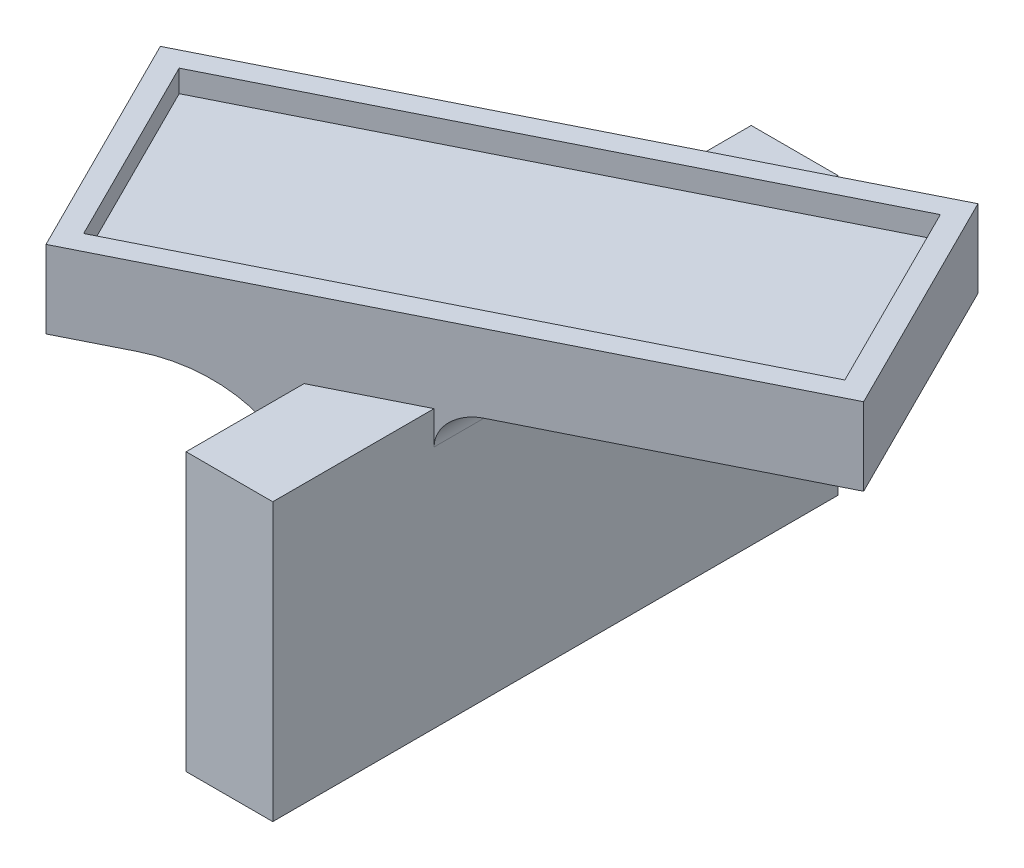
ISO-10303-21;
HEADER;
FILE_DESCRIPTION(('STEP AP214'),'2;1');
FILE_NAME('part.step','',(''),(''),'','','');
FILE_SCHEMA(('AUTOMOTIVE_DESIGN { 1 0 10303 214 1 1 1 1 }'));
ENDSEC;
DATA;
#1=APPLICATION_CONTEXT('core data for automotive mechanical design processes');
#2=APPLICATION_PROTOCOL_DEFINITION('international standard','automotive_design',2000,#1);
#3=PRODUCT_CONTEXT('',#1,'mechanical');
#4=PRODUCT('Part','Part','',(#3));
#5=PRODUCT_RELATED_PRODUCT_CATEGORY('part','',(#4));
#6=PRODUCT_DEFINITION_FORMATION('','',#4);
#7=PRODUCT_DEFINITION_CONTEXT('part definition',#1,'design');
#8=PRODUCT_DEFINITION('design','',#6,#7);
#9=PRODUCT_DEFINITION_SHAPE('','',#8);
#10=(LENGTH_UNIT() NAMED_UNIT(*) SI_UNIT(.MILLI.,.METRE.));
#11=(NAMED_UNIT(*) PLANE_ANGLE_UNIT() SI_UNIT($,.RADIAN.));
#12=(NAMED_UNIT(*) SI_UNIT($,.STERADIAN.) SOLID_ANGLE_UNIT());
#13=UNCERTAINTY_MEASURE_WITH_UNIT(LENGTH_MEASURE(1.E-05),#10,'distance_accuracy_value','');
#14=(GEOMETRIC_REPRESENTATION_CONTEXT(3) GLOBAL_UNCERTAINTY_ASSIGNED_CONTEXT((#13)) GLOBAL_UNIT_ASSIGNED_CONTEXT((#10,
#11,#12)) REPRESENTATION_CONTEXT('',''));
#15=CARTESIAN_POINT('',(0.,0.,0.));
#16=DIRECTION('',(0.,0.,1.));
#17=DIRECTION('',(1.,0.,0.));
#18=AXIS2_PLACEMENT_3D('',#15,#16,#17);
#19=CARTESIAN_POINT('',(-3.91,25.,25.5));
#20=DIRECTION('',(1.,0.,0.));
#21=DIRECTION('',(0.,0.,-1.));
#22=AXIS2_PLACEMENT_3D('',#19,#20,#21);
#23=PLANE('',#22);
#24=DIRECTION('',(0.,0.,1.));
#25=VECTOR('',#24,1.);
#26=CARTESIAN_POINT('',(-3.91,0.,25.5));
#27=LINE('',#26,#25);
#28=CARTESIAN_POINT('',(-3.91,0.,-25.5));
#29=VERTEX_POINT('',#28);
#30=CARTESIAN_POINT('',(-3.91,0.,-2.5));
#31=VERTEX_POINT('',#30);
#32=EDGE_CURVE('E325',#29,#31,#27,.T.);
#33=ORIENTED_EDGE('',*,*,#32,.T.);
#34=DIRECTION('',(0.,1.,0.));
#35=VECTOR('',#34,1.);
#36=CARTESIAN_POINT('',(-3.91,5.,-2.5));
#37=LINE('',#36,#35);
#38=CARTESIAN_POINT('',(-3.91,6.,-2.5));
#39=VERTEX_POINT('',#38);
#40=EDGE_CURVE('E381',#31,#39,#37,.T.);
#41=ORIENTED_EDGE('',*,*,#40,.T.);
#42=DIRECTION('',(0.,0.,1.));
#43=VECTOR('',#42,1.);
#44=CARTESIAN_POINT('',(-3.91,6.,1.5));
#45=LINE('',#44,#43);
#46=CARTESIAN_POINT('',(-3.91,6.,2.49999999999999));
#47=VERTEX_POINT('',#46);
#48=EDGE_CURVE('E379',#39,#47,#45,.T.);
#49=ORIENTED_EDGE('',*,*,#48,.T.);
#50=DIRECTION('',(0.,-1.,0.));
#51=VECTOR('',#50,1.);
#52=CARTESIAN_POINT('',(-3.91,0.,2.49999999999999));
#53=LINE('',#52,#51);
#54=CARTESIAN_POINT('',(-3.91,0.,2.49999999999999));
#55=VERTEX_POINT('',#54);
#56=EDGE_CURVE('E377',#47,#55,#53,.T.);
#57=ORIENTED_EDGE('',*,*,#56,.T.);
#58=CARTESIAN_POINT('',(-3.91,0.,25.5));
#59=VERTEX_POINT('',#58);
#60=EDGE_CURVE('E324',#55,#59,#27,.T.);
#61=ORIENTED_EDGE('',*,*,#60,.T.);
#62=DIRECTION('',(0.,-1.,0.));
#63=VECTOR('',#62,1.);
#64=CARTESIAN_POINT('',(-3.91,25.,25.5));
#65=LINE('',#64,#63);
#66=CARTESIAN_POINT('',(-3.91,25.,25.5));
#67=VERTEX_POINT('',#66);
#68=EDGE_CURVE('E333',#67,#59,#65,.T.);
#69=ORIENTED_EDGE('',*,*,#68,.F.);
#70=DIRECTION('',(0.,0.,1.));
#71=VECTOR('',#70,1.);
#72=CARTESIAN_POINT('',(-3.91,25.,25.5));
#73=LINE('',#72,#71);
#74=CARTESIAN_POINT('',(-3.91,25.,14.851522064765));
#75=VERTEX_POINT('',#74);
#76=EDGE_CURVE('E313',#75,#67,#73,.T.);
#77=ORIENTED_EDGE('',*,*,#76,.F.);
#78=DIRECTION('',(0.,-1.,0.));
#79=VECTOR('',#78,1.);
#80=CARTESIAN_POINT('',(-3.91,30.,14.851522064765));
#81=LINE('',#80,#79);
#82=CARTESIAN_POINT('',(-3.91,15.,14.851522064765));
#83=VERTEX_POINT('',#82);
#84=EDGE_CURVE('E350',#75,#83,#81,.T.);
#85=ORIENTED_EDGE('',*,*,#84,.T.);
#86=DIRECTION('',(0.,0.,1.));
#87=VECTOR('',#86,1.);
#88=CARTESIAN_POINT('',(-3.91,15.,-10.9415220608544));
#89=LINE('',#88,#87);
#90=CARTESIAN_POINT('',(-3.91,15.,-10.9415220608544));
#91=VERTEX_POINT('',#90);
#92=EDGE_CURVE('E347',#83,#91,#89,.F.);
#93=ORIENTED_EDGE('',*,*,#92,.T.);
#94=DIRECTION('',(0.,1.,0.));
#95=VECTOR('',#94,1.);
#96=CARTESIAN_POINT('',(-3.91,30.,-10.9415220608544));
#97=LINE('',#96,#95);
#98=CARTESIAN_POINT('',(-3.91000000000001,25.,-10.9415220608544));
#99=VERTEX_POINT('',#98);
#100=EDGE_CURVE('E345',#91,#99,#97,.T.);
#101=ORIENTED_EDGE('',*,*,#100,.T.);
#102=CARTESIAN_POINT('',(-3.91,25.,-25.5));
#103=VERTEX_POINT('',#102);
#104=EDGE_CURVE('E314',#103,#99,#73,.T.);
#105=ORIENTED_EDGE('',*,*,#104,.F.);
#106=DIRECTION('',(0.,-1.,0.));
#107=VECTOR('',#106,1.);
#108=CARTESIAN_POINT('',(-3.91,25.,-25.5));
#109=LINE('',#108,#107);
#110=EDGE_CURVE('E336',#103,#29,#109,.T.);
#111=ORIENTED_EDGE('',*,*,#110,.T.);
#112=EDGE_LOOP('',(#33,#41,#49,#57,#61,#69,#77,#85,#93,#101,#105,#111));
#113=FACE_BOUND('',#112,.T.);
#114=ADVANCED_FACE('F35',(#113),#23,.F.);
#115=CARTESIAN_POINT('',(0.,25.,0.));
#116=DIRECTION('',(0.,-1.,0.));
#117=DIRECTION('',(0.,0.,-1.));
#118=AXIS2_PLACEMENT_3D('',#115,#116,#117);
#119=PLANE('',#118);
#120=DIRECTION('',(0.894427190821005,0.,-0.44721359585778));
#121=VECTOR('',#120,1.);
#122=CARTESIAN_POINT('',(-19.4381389193581,25.,22.6155915322092));
#123=LINE('',#122,#121);
#124=CARTESIAN_POINT('',(3.91,25.,10.9415220608544));
#125=VERTEX_POINT('',#124);
#126=EDGE_CURVE('E294',#75,#125,#123,.T.);
#127=ORIENTED_EDGE('',*,*,#126,.F.);
#128=ORIENTED_EDGE('',*,*,#76,.T.);
#129=DIRECTION('',(1.,0.,0.));
#130=VECTOR('',#129,1.);
#131=CARTESIAN_POINT('',(-3.91,25.,25.5));
#132=LINE('',#131,#130);
#133=CARTESIAN_POINT('',(3.91,25.,25.5));
#134=VERTEX_POINT('',#133);
#135=EDGE_CURVE('E317',#67,#134,#132,.T.);
#136=ORIENTED_EDGE('',*,*,#135,.T.);
#137=DIRECTION('',(0.,0.,-1.));
#138=VECTOR('',#137,1.);
#139=CARTESIAN_POINT('',(3.91,25.,25.5));
#140=LINE('',#139,#138);
#141=EDGE_CURVE('E307',#134,#125,#140,.T.);
#142=ORIENTED_EDGE('',*,*,#141,.T.);
#143=EDGE_LOOP('',(#127,#128,#136,#142));
#144=FACE_BOUND('',#143,.T.);
#145=ADVANCED_FACE('F438',(#144),#119,.F.);
#146=DIRECTION('',(-0.894427190821005,0.,0.44721359585778));
#147=VECTOR('',#146,1.);
#148=CARTESIAN_POINT('',(19.4381389193581,25.,-22.6155915322092));
#149=LINE('',#148,#147);
#150=CARTESIAN_POINT('',(3.91,25.,-14.851522064765));
#151=VERTEX_POINT('',#150);
#152=EDGE_CURVE('E287',#151,#99,#149,.T.);
#153=ORIENTED_EDGE('',*,*,#152,.F.);
#154=CARTESIAN_POINT('',(3.91,25.,-25.5));
#155=VERTEX_POINT('',#154);
#156=EDGE_CURVE('E311',#151,#155,#140,.T.);
#157=ORIENTED_EDGE('',*,*,#156,.T.);
#158=DIRECTION('',(-1.,0.,0.));
#159=VECTOR('',#158,1.);
#160=CARTESIAN_POINT('',(-3.91,25.,-25.5));
#161=LINE('',#160,#159);
#162=EDGE_CURVE('E310',#155,#103,#161,.T.);
#163=ORIENTED_EDGE('',*,*,#162,.T.);
#164=ORIENTED_EDGE('',*,*,#104,.T.);
#165=EDGE_LOOP('',(#153,#157,#163,#164));
#166=FACE_BOUND('',#165,.T.);
#167=ADVANCED_FACE('F473',(#166),#119,.F.);
#168=CARTESIAN_POINT('',(3.91,25.,25.5));
#169=DIRECTION('',(-1.,0.,0.));
#170=DIRECTION('',(0.,0.,1.));
#171=AXIS2_PLACEMENT_3D('',#168,#169,#170);
#172=PLANE('',#171);
#173=ORIENTED_EDGE('',*,*,#156,.F.);
#174=DIRECTION('',(0.,-1.,0.));
#175=VECTOR('',#174,1.);
#176=CARTESIAN_POINT('',(3.91,30.,-14.851522064765));
#177=LINE('',#176,#175);
#178=CARTESIAN_POINT('',(3.91,22.,-14.851522064765));
#179=VERTEX_POINT('',#178);
#180=EDGE_CURVE('E365',#151,#179,#177,.T.);
#181=ORIENTED_EDGE('',*,*,#180,.T.);
#182=DIRECTION('',(0.,0.,-1.));
#183=VECTOR('',#182,1.);
#184=CARTESIAN_POINT('',(3.91,22.,10.9415220608544));
#185=LINE('',#184,#183);
#186=CARTESIAN_POINT('',(3.91,22.,10.9415220608544));
#187=VERTEX_POINT('',#186);
#188=EDGE_CURVE('E362',#179,#187,#185,.F.);
#189=ORIENTED_EDGE('',*,*,#188,.T.);
#190=DIRECTION('',(0.,1.,0.));
#191=VECTOR('',#190,1.);
#192=CARTESIAN_POINT('',(3.91,30.,10.9415220608544));
#193=LINE('',#192,#191);
#194=EDGE_CURVE('E360',#187,#125,#193,.T.);
#195=ORIENTED_EDGE('',*,*,#194,.T.);
#196=ORIENTED_EDGE('',*,*,#141,.F.);
#197=DIRECTION('',(0.,-1.,0.));
#198=VECTOR('',#197,1.);
#199=CARTESIAN_POINT('',(3.91,25.,25.5));
#200=LINE('',#199,#198);
#201=CARTESIAN_POINT('',(3.91,0.,25.5));
#202=VERTEX_POINT('',#201);
#203=EDGE_CURVE('E319',#134,#202,#200,.T.);
#204=ORIENTED_EDGE('',*,*,#203,.T.);
#205=DIRECTION('',(0.,0.,-1.));
#206=VECTOR('',#205,1.);
#207=CARTESIAN_POINT('',(3.91,0.,25.5));
#208=LINE('',#207,#206);
#209=CARTESIAN_POINT('',(3.91,0.,-25.5));
#210=VERTEX_POINT('',#209);
#211=EDGE_CURVE('E306',#202,#210,#208,.T.);
#212=ORIENTED_EDGE('',*,*,#211,.T.);
#213=DIRECTION('',(0.,-1.,0.));
#214=VECTOR('',#213,1.);
#215=CARTESIAN_POINT('',(3.91,25.,-25.5));
#216=LINE('',#215,#214);
#217=EDGE_CURVE('E339',#155,#210,#216,.T.);
#218=ORIENTED_EDGE('',*,*,#217,.F.);
#219=EDGE_LOOP('',(#173,#181,#189,#195,#196,#204,#212,#218));
#220=FACE_BOUND('',#219,.T.);
#221=ADVANCED_FACE('F433',(#220),#172,.F.);
#222=CARTESIAN_POINT('',(-3.91,25.,-25.5));
#223=DIRECTION('',(0.,0.,1.));
#224=DIRECTION('',(1.,0.,0.));
#225=AXIS2_PLACEMENT_3D('',#222,#223,#224);
#226=PLANE('',#225);
#227=DIRECTION('',(-1.,0.,0.));
#228=VECTOR('',#227,1.);
#229=CARTESIAN_POINT('',(-3.91,0.,-25.5));
#230=LINE('',#229,#228);
#231=EDGE_CURVE('E322',#210,#29,#230,.T.);
#232=ORIENTED_EDGE('',*,*,#231,.T.);
#233=ORIENTED_EDGE('',*,*,#110,.F.);
#234=ORIENTED_EDGE('',*,*,#162,.F.);
#235=ORIENTED_EDGE('',*,*,#217,.T.);
#236=EDGE_LOOP('',(#232,#233,#234,#235));
#237=FACE_BOUND('',#236,.T.);
#238=ADVANCED_FACE('F478',(#237),#226,.F.);
#239=CARTESIAN_POINT('',(-3.91,25.,25.5));
#240=DIRECTION('',(0.,0.,-1.));
#241=DIRECTION('',(-1.,0.,0.));
#242=AXIS2_PLACEMENT_3D('',#239,#240,#241);
#243=PLANE('',#242);
#244=DIRECTION('',(1.,0.,0.));
#245=VECTOR('',#244,1.);
#246=CARTESIAN_POINT('',(-3.91,0.,25.5));
#247=LINE('',#246,#245);
#248=EDGE_CURVE('E328',#59,#202,#247,.T.);
#249=ORIENTED_EDGE('',*,*,#248,.T.);
#250=ORIENTED_EDGE('',*,*,#203,.F.);
#251=ORIENTED_EDGE('',*,*,#135,.F.);
#252=ORIENTED_EDGE('',*,*,#68,.T.);
#253=EDGE_LOOP('',(#249,#250,#251,#252));
#254=FACE_BOUND('',#253,.T.);
#255=ADVANCED_FACE('F425',(#254),#243,.F.);
#256=CARTESIAN_POINT('',(0.,0.,0.));
#257=DIRECTION('',(0.,-1.,0.));
#258=DIRECTION('',(0.,0.,-1.));
#259=AXIS2_PLACEMENT_3D('',#256,#257,#258);
#260=PLANE('',#259);
#261=ORIENTED_EDGE('',*,*,#211,.F.);
#262=ORIENTED_EDGE('',*,*,#248,.F.);
#263=ORIENTED_EDGE('',*,*,#60,.F.);
#264=DIRECTION('',(0.70710678118655,0.,0.707106781186545));
#265=VECTOR('',#264,1.);
#266=CARTESIAN_POINT('',(-4.91,0.,1.5));
#267=LINE('',#266,#265);
#268=CARTESIAN_POINT('',(-4.91,0.,1.5));
#269=VERTEX_POINT('',#268);
#270=EDGE_CURVE('E11',#55,#269,#267,.F.);
#271=ORIENTED_EDGE('',*,*,#270,.T.);
#272=DIRECTION('',(-1.,0.,0.));
#273=VECTOR('',#272,1.);
#274=CARTESIAN_POINT('',(-6.41,0.,1.5));
#275=LINE('',#274,#273);
#276=CARTESIAN_POINT('',(-3.91,0.,1.5));
#277=VERTEX_POINT('',#276);
#278=EDGE_CURVE('E51',#277,#269,#275,.T.);
#279=ORIENTED_EDGE('',*,*,#278,.F.);
#280=CARTESIAN_POINT('',(-3.91,0.,-1.5));
#281=VERTEX_POINT('',#280);
#282=EDGE_CURVE('E329',#281,#277,#27,.T.);
#283=ORIENTED_EDGE('',*,*,#282,.F.);
#284=DIRECTION('',(1.,0.,0.));
#285=VECTOR('',#284,1.);
#286=CARTESIAN_POINT('',(-6.41,0.,-1.5));
#287=LINE('',#286,#285);
#288=CARTESIAN_POINT('',(-4.91,0.,-1.5));
#289=VERTEX_POINT('',#288);
#290=EDGE_CURVE('E372',#289,#281,#287,.T.);
#291=ORIENTED_EDGE('',*,*,#290,.F.);
#292=DIRECTION('',(-0.70710678118655,0.,0.707106781186546));
#293=VECTOR('',#292,1.);
#294=CARTESIAN_POINT('',(-4.91,0.,-1.5));
#295=LINE('',#294,#293);
#296=EDGE_CURVE('E44',#289,#31,#295,.F.);
#297=ORIENTED_EDGE('',*,*,#296,.T.);
#298=ORIENTED_EDGE('',*,*,#32,.F.);
#299=ORIENTED_EDGE('',*,*,#231,.F.);
#300=EDGE_LOOP('',(#261,#262,#263,#271,#279,#283,#291,#297,#298,#299));
#301=FACE_BOUND('',#300,.T.);
#302=ADVANCED_FACE('F428',(#301),#260,.T.);
#303=CARTESIAN_POINT('',(0.,25.,0.));
#304=DIRECTION('',(0.,1.,0.));
#305=DIRECTION('',(0.,0.,1.));
#306=AXIS2_PLACEMENT_3D('',#303,#304,#305);
#307=PLANE('',#306);
#308=CARTESIAN_POINT('',(6.91,25.,9.44152205935421));
#309=VERTEX_POINT('',#308);
#310=CARTESIAN_POINT('',(29.7553565757971,25.,-1.98115623996866));
#311=VERTEX_POINT('',#310);
#312=EDGE_CURVE('E289',#309,#311,#123,.T.);
#313=ORIENTED_EDGE('',*,*,#312,.F.);
#314=DIRECTION('',(0.,0.,-1.));
#315=VECTOR('',#314,1.);
#316=CARTESIAN_POINT('',(6.91,25.,-14.851522064765));
#317=LINE('',#316,#315);
#318=CARTESIAN_POINT('',(6.91,25.,-16.3515220662652));
#319=VERTEX_POINT('',#318);
#320=EDGE_CURVE('E357',#309,#319,#317,.T.);
#321=ORIENTED_EDGE('',*,*,#320,.T.);
#322=CARTESIAN_POINT('',(19.4381389193581,25.,-22.6155915322092));
#323=VERTEX_POINT('',#322);
#324=EDGE_CURVE('E283',#323,#319,#149,.T.);
#325=ORIENTED_EDGE('',*,*,#324,.F.);
#326=DIRECTION('',(-0.44721359585778,0.,-0.894427190821005));
#327=VECTOR('',#326,1.);
#328=CARTESIAN_POINT('',(29.7553565757971,25.,-1.98115623996866));
#329=LINE('',#328,#327);
#330=EDGE_CURVE('E279',#311,#323,#329,.T.);
#331=ORIENTED_EDGE('',*,*,#330,.F.);
#332=EDGE_LOOP('',(#313,#321,#325,#331));
#333=FACE_BOUND('',#332,.T.);
#334=ADVANCED_FACE('F451',(#333),#307,.F.);
#335=CARTESIAN_POINT('',(-13.91,25.,-5.9415220558537));
#336=VERTEX_POINT('',#335);
#337=CARTESIAN_POINT('',(-29.7553565757971,25.,1.98115623996867));
#338=VERTEX_POINT('',#337);
#339=EDGE_CURVE('E282',#336,#338,#149,.T.);
#340=ORIENTED_EDGE('',*,*,#339,.F.);
#341=DIRECTION('',(0.,0.,1.));
#342=VECTOR('',#341,1.);
#343=CARTESIAN_POINT('',(-13.91,25.,14.851522064765));
#344=LINE('',#343,#342);
#345=CARTESIAN_POINT('',(-13.91,25.,19.8515220697657));
#346=VERTEX_POINT('',#345);
#347=EDGE_CURVE('E342',#336,#346,#344,.T.);
#348=ORIENTED_EDGE('',*,*,#347,.T.);
#349=CARTESIAN_POINT('',(-19.4381389193581,25.,22.6155915322092));
#350=VERTEX_POINT('',#349);
#351=EDGE_CURVE('E290',#350,#346,#123,.T.);
#352=ORIENTED_EDGE('',*,*,#351,.F.);
#353=DIRECTION('',(0.44721359585778,0.,0.894427190821005));
#354=VECTOR('',#353,1.);
#355=CARTESIAN_POINT('',(-29.7553565757971,25.,1.98115623996867));
#356=LINE('',#355,#354);
#357=EDGE_CURVE('E286',#338,#350,#356,.T.);
#358=ORIENTED_EDGE('',*,*,#357,.F.);
#359=EDGE_LOOP('',(#340,#348,#352,#358));
#360=FACE_BOUND('',#359,.T.);
#361=ADVANCED_FACE('F464',(#360),#307,.F.);
#362=CARTESIAN_POINT('',(29.7553565757971,30.,-1.98115623996866));
#363=DIRECTION('',(-0.894427190821005,0.,0.44721359585778));
#364=DIRECTION('',(0.44721359585778,0.,0.894427190821005));
#365=AXIS2_PLACEMENT_3D('',#362,#363,#364);
#366=PLANE('',#365);
#367=ORIENTED_EDGE('',*,*,#330,.T.);
#368=DIRECTION('',(0.,-1.,0.));
#369=VECTOR('',#368,1.);
#370=CARTESIAN_POINT('',(19.4381389193581,30.,-22.6155915322092));
#371=LINE('',#370,#369);
#372=CARTESIAN_POINT('',(19.4381389193581,32.,-22.6155915322092));
#373=VERTEX_POINT('',#372);
#374=EDGE_CURVE('E303',#373,#323,#371,.T.);
#375=ORIENTED_EDGE('',*,*,#374,.F.);
#376=DIRECTION('',(-0.44721359585778,0.,-0.894427190821005));
#377=VECTOR('',#376,1.);
#378=CARTESIAN_POINT('',(24.5967477475776,32.,-12.2983738860889));
#379=LINE('',#378,#377);
#380=CARTESIAN_POINT('',(29.7553565757971,32.,-1.98115623996866));
#381=VERTEX_POINT('',#380);
#382=EDGE_CURVE('E245',#381,#373,#379,.T.);
#383=ORIENTED_EDGE('',*,*,#382,.F.);
#384=DIRECTION('',(0.,-1.,0.));
#385=VECTOR('',#384,1.);
#386=CARTESIAN_POINT('',(29.7553565757971,30.,-1.98115623996866));
#387=LINE('',#386,#385);
#388=EDGE_CURVE('E293',#381,#311,#387,.T.);
#389=ORIENTED_EDGE('',*,*,#388,.T.);
#390=EDGE_LOOP('',(#367,#375,#383,#389));
#391=FACE_BOUND('',#390,.T.);
#392=ADVANCED_FACE('F450',(#391),#366,.F.);
#393=CARTESIAN_POINT('',(19.4381389193581,30.,-22.6155915322092));
#394=DIRECTION('',(0.44721359585778,0.,0.894427190821005));
#395=DIRECTION('',(0.894427190821005,0.,-0.44721359585778));
#396=AXIS2_PLACEMENT_3D('',#393,#394,#395);
#397=PLANE('',#396);
#398=ORIENTED_EDGE('',*,*,#324,.T.);
#399=CARTESIAN_POINT('',(6.91,22.,-16.3515220662652));
#400=DIRECTION('',(0.44721359585778,0.,0.894427190821005));
#401=DIRECTION('',(-0.894427190821005,0.,0.44721359585778));
#402=AXIS2_PLACEMENT_3D('',#399,#400,#401);
#403=ELLIPSE('',#402,3.3541019669206,3.);
#404=EDGE_CURVE('E368',#319,#179,#403,.T.);
#405=ORIENTED_EDGE('',*,*,#404,.T.);
#406=ORIENTED_EDGE('',*,*,#180,.F.);
#407=ORIENTED_EDGE('',*,*,#152,.T.);
#408=ORIENTED_EDGE('',*,*,#100,.F.);
#409=CARTESIAN_POINT('',(-13.91,15.,-5.9415220558537));
#410=DIRECTION('',(0.44721359585778,0.,0.894427190821005));
#411=DIRECTION('',(0.894427190821005,0.,-0.44721359585778));
#412=AXIS2_PLACEMENT_3D('',#409,#410,#411);
#413=ELLIPSE('',#412,11.1803398897353,10.);
#414=EDGE_CURVE('E355',#91,#336,#413,.T.);
#415=ORIENTED_EDGE('',*,*,#414,.T.);
#416=ORIENTED_EDGE('',*,*,#339,.T.);
#417=DIRECTION('',(0.,-1.,0.));
#418=VECTOR('',#417,1.);
#419=CARTESIAN_POINT('',(-29.7553565757971,30.,1.98115623996867));
#420=LINE('',#419,#418);
#421=CARTESIAN_POINT('',(-29.7553565757971,32.,1.98115623996867));
#422=VERTEX_POINT('',#421);
#423=EDGE_CURVE('E300',#422,#338,#420,.T.);
#424=ORIENTED_EDGE('',*,*,#423,.F.);
#425=DIRECTION('',(-0.894427190821005,0.,0.44721359585778));
#426=VECTOR('',#425,1.);
#427=CARTESIAN_POINT('',(-5.15860882821949,32.,-10.3172176461203));
#428=LINE('',#427,#426);
#429=EDGE_CURVE('E249',#373,#422,#428,.T.);
#430=ORIENTED_EDGE('',*,*,#429,.F.);
#431=ORIENTED_EDGE('',*,*,#374,.T.);
#432=EDGE_LOOP('',(#398,#405,#406,#407,#408,#415,#416,#424,#430,#431));
#433=FACE_BOUND('',#432,.T.);
#434=ADVANCED_FACE('F454',(#433),#397,.F.);
#435=CARTESIAN_POINT('',(-29.7553565757971,30.,1.98115623996867));
#436=DIRECTION('',(0.894427190821005,0.,-0.44721359585778));
#437=DIRECTION('',(-0.44721359585778,0.,-0.894427190821005));
#438=AXIS2_PLACEMENT_3D('',#435,#436,#437);
#439=PLANE('',#438);
#440=ORIENTED_EDGE('',*,*,#357,.T.);
#441=DIRECTION('',(0.,-1.,0.));
#442=VECTOR('',#441,1.);
#443=CARTESIAN_POINT('',(-19.4381389193581,30.,22.6155915322092));
#444=LINE('',#443,#442);
#445=CARTESIAN_POINT('',(-19.4381389193581,32.,22.6155915322092));
#446=VERTEX_POINT('',#445);
#447=EDGE_CURVE('E297',#446,#350,#444,.T.);
#448=ORIENTED_EDGE('',*,*,#447,.F.);
#449=DIRECTION('',(0.44721359585778,0.,0.894427190821005));
#450=VECTOR('',#449,1.);
#451=CARTESIAN_POINT('',(-24.5967477475776,32.,12.2983738860889));
#452=LINE('',#451,#450);
#453=EDGE_CURVE('E252',#422,#446,#452,.T.);
#454=ORIENTED_EDGE('',*,*,#453,.F.);
#455=ORIENTED_EDGE('',*,*,#423,.T.);
#456=EDGE_LOOP('',(#440,#448,#454,#455));
#457=FACE_BOUND('',#456,.T.);
#458=ADVANCED_FACE('F550',(#457),#439,.F.);
#459=CARTESIAN_POINT('',(-19.4381389193581,30.,22.6155915322092));
#460=DIRECTION('',(-0.44721359585778,0.,-0.894427190821005));
#461=DIRECTION('',(-0.894427190821005,0.,0.44721359585778));
#462=AXIS2_PLACEMENT_3D('',#459,#460,#461);
#463=PLANE('',#462);
#464=ORIENTED_EDGE('',*,*,#351,.T.);
#465=CARTESIAN_POINT('',(-13.91,15.,19.8515220697657));
#466=DIRECTION('',(-0.44721359585778,0.,-0.894427190821005));
#467=DIRECTION('',(0.894427190821005,0.,-0.44721359585778));
#468=AXIS2_PLACEMENT_3D('',#465,#466,#467);
#469=ELLIPSE('',#468,11.1803398897353,10.);
#470=EDGE_CURVE('E353',#346,#83,#469,.T.);
#471=ORIENTED_EDGE('',*,*,#470,.T.);
#472=ORIENTED_EDGE('',*,*,#84,.F.);
#473=ORIENTED_EDGE('',*,*,#126,.T.);
#474=ORIENTED_EDGE('',*,*,#194,.F.);
#475=CARTESIAN_POINT('',(6.91,22.,9.44152205935421));
#476=DIRECTION('',(-0.44721359585778,0.,-0.894427190821005));
#477=DIRECTION('',(-0.894427190821005,0.,0.44721359585778));
#478=AXIS2_PLACEMENT_3D('',#475,#476,#477);
#479=ELLIPSE('',#478,3.3541019669206,3.);
#480=EDGE_CURVE('E370',#187,#309,#479,.T.);
#481=ORIENTED_EDGE('',*,*,#480,.T.);
#482=ORIENTED_EDGE('',*,*,#312,.T.);
#483=ORIENTED_EDGE('',*,*,#388,.F.);
#484=DIRECTION('',(0.894427190821005,0.,-0.44721359585778));
#485=VECTOR('',#484,1.);
#486=CARTESIAN_POINT('',(5.15860882821949,32.,10.3172176461203));
#487=LINE('',#486,#485);
#488=EDGE_CURVE('E242',#446,#381,#487,.T.);
#489=ORIENTED_EDGE('',*,*,#488,.F.);
#490=ORIENTED_EDGE('',*,*,#447,.T.);
#491=EDGE_LOOP('',(#464,#471,#472,#473,#474,#481,#482,#483,#489,#490));
#492=FACE_BOUND('',#491,.T.);
#493=ADVANCED_FACE('F440',(#492),#463,.F.);
#494=CARTESIAN_POINT('',(22.8973360850177,32.,-11.4486680539592));
#495=DIRECTION('',(0.894427190821005,0.,-0.447213595857781));
#496=DIRECTION('',(-0.447213595857781,0.,-0.894427190821005));
#497=AXIS2_PLACEMENT_3D('',#494,#495,#496);
#498=PLANE('',#497);
#499=DIRECTION('',(0.447213595857781,0.,0.894427190821005));
#500=VECTOR('',#499,1.);
#501=CARTESIAN_POINT('',(22.8973360850177,30.,-11.4486680539592));
#502=LINE('',#501,#500);
#503=CARTESIAN_POINT('',(18.588433088928,30.,-20.0664740375196));
#504=VERTEX_POINT('',#503);
#505=CARTESIAN_POINT('',(27.2062390811074,30.,-2.83086207039879));
#506=VERTEX_POINT('',#505);
#507=EDGE_CURVE('E233',#504,#506,#502,.T.);
#508=ORIENTED_EDGE('',*,*,#507,.T.);
#509=DIRECTION('',(0.,-1.,0.));
#510=VECTOR('',#509,1.);
#511=CARTESIAN_POINT('',(27.2062390811074,32.,-2.83086207039879));
#512=LINE('',#511,#510);
#513=CARTESIAN_POINT('',(27.2062390811074,32.,-2.83086207039879));
#514=VERTEX_POINT('',#513);
#515=EDGE_CURVE('E277',#514,#506,#512,.T.);
#516=ORIENTED_EDGE('',*,*,#515,.F.);
#517=DIRECTION('',(0.447213595857781,0.,0.894427190821005));
#518=VECTOR('',#517,1.);
#519=CARTESIAN_POINT('',(22.8973360850177,32.,-11.4486680539592));
#520=LINE('',#519,#518);
#521=CARTESIAN_POINT('',(18.588433088928,32.,-20.0664740375196));
#522=VERTEX_POINT('',#521);
#523=EDGE_CURVE('E255',#522,#514,#520,.T.);
#524=ORIENTED_EDGE('',*,*,#523,.F.);
#525=DIRECTION('',(0.,-1.,0.));
#526=VECTOR('',#525,1.);
#527=CARTESIAN_POINT('',(18.588433088928,32.,-20.0664740375196));
#528=LINE('',#527,#526);
#529=EDGE_CURVE('E263',#522,#504,#528,.T.);
#530=ORIENTED_EDGE('',*,*,#529,.T.);
#531=EDGE_LOOP('',(#508,#516,#524,#530));
#532=FACE_BOUND('',#531,.T.);
#533=ADVANCED_FACE('F549',(#532),#498,.F.);
#534=CARTESIAN_POINT('',(4.30890299608971,32.,8.61780598356038));
#535=DIRECTION('',(0.44721359585778,0.,0.894427190821005));
#536=DIRECTION('',(0.894427190821005,0.,-0.44721359585778));
#537=AXIS2_PLACEMENT_3D('',#534,#535,#536);
#538=PLANE('',#537);
#539=DIRECTION('',(-0.894427190821005,0.,0.44721359585778));
#540=VECTOR('',#539,1.);
#541=CARTESIAN_POINT('',(4.30890299608971,30.,8.61780598356038));
#542=LINE('',#541,#540);
#543=CARTESIAN_POINT('',(-18.588433088928,30.,20.0664740375196));
#544=VERTEX_POINT('',#543);
#545=EDGE_CURVE('E236',#506,#544,#542,.T.);
#546=ORIENTED_EDGE('',*,*,#545,.T.);
#547=DIRECTION('',(0.,-1.,0.));
#548=VECTOR('',#547,1.);
#549=CARTESIAN_POINT('',(-18.588433088928,32.,20.0664740375196));
#550=LINE('',#549,#548);
#551=CARTESIAN_POINT('',(-18.588433088928,32.,20.0664740375196));
#552=VERTEX_POINT('',#551);
#553=EDGE_CURVE('E274',#552,#544,#550,.T.);
#554=ORIENTED_EDGE('',*,*,#553,.F.);
#555=DIRECTION('',(-0.894427190821005,0.,0.44721359585778));
#556=VECTOR('',#555,1.);
#557=CARTESIAN_POINT('',(4.30890299608971,32.,8.61780598356038));
#558=LINE('',#557,#556);
#559=EDGE_CURVE('E258',#514,#552,#558,.T.);
#560=ORIENTED_EDGE('',*,*,#559,.F.);
#561=ORIENTED_EDGE('',*,*,#515,.T.);
#562=EDGE_LOOP('',(#546,#554,#560,#561));
#563=FACE_BOUND('',#562,.T.);
#564=ADVANCED_FACE('F635',(#563),#538,.F.);
#565=CARTESIAN_POINT('',(-22.8973360850177,32.,11.4486680539592));
#566=DIRECTION('',(-0.894427190821005,0.,0.44721359585778));
#567=DIRECTION('',(0.44721359585778,0.,0.894427190821005));
#568=AXIS2_PLACEMENT_3D('',#565,#566,#567);
#569=PLANE('',#568);
#570=DIRECTION('',(-0.44721359585778,0.,-0.894427190821005));
#571=VECTOR('',#570,1.);
#572=CARTESIAN_POINT('',(-22.8973360850177,30.,11.4486680539592));
#573=LINE('',#572,#571);
#574=CARTESIAN_POINT('',(-27.2062390811074,30.,2.8308620703988));
#575=VERTEX_POINT('',#574);
#576=EDGE_CURVE('E266',#544,#575,#573,.T.);
#577=ORIENTED_EDGE('',*,*,#576,.T.);
#578=DIRECTION('',(0.,-1.,0.));
#579=VECTOR('',#578,1.);
#580=CARTESIAN_POINT('',(-27.2062390811074,32.,2.8308620703988));
#581=LINE('',#580,#579);
#582=CARTESIAN_POINT('',(-27.2062390811074,32.,2.8308620703988));
#583=VERTEX_POINT('',#582);
#584=EDGE_CURVE('E272',#583,#575,#581,.T.);
#585=ORIENTED_EDGE('',*,*,#584,.F.);
#586=DIRECTION('',(-0.44721359585778,0.,-0.894427190821005));
#587=VECTOR('',#586,1.);
#588=CARTESIAN_POINT('',(-22.8973360850177,32.,11.4486680539592));
#589=LINE('',#588,#587);
#590=EDGE_CURVE('E260',#552,#583,#589,.T.);
#591=ORIENTED_EDGE('',*,*,#590,.F.);
#592=ORIENTED_EDGE('',*,*,#553,.T.);
#593=EDGE_LOOP('',(#577,#585,#591,#592));
#594=FACE_BOUND('',#593,.T.);
#595=ADVANCED_FACE('F625',(#594),#569,.F.);
#596=CARTESIAN_POINT('',(-4.30890299608971,32.,-8.61780598356038));
#597=DIRECTION('',(-0.44721359585778,0.,-0.894427190821005));
#598=DIRECTION('',(-0.894427190821005,0.,0.44721359585778));
#599=AXIS2_PLACEMENT_3D('',#596,#597,#598);
#600=PLANE('',#599);
#601=DIRECTION('',(0.894427190821005,0.,-0.44721359585778));
#602=VECTOR('',#601,1.);
#603=CARTESIAN_POINT('',(-4.30890299608971,30.,-8.61780598356038));
#604=LINE('',#603,#602);
#605=EDGE_CURVE('E246',#575,#504,#604,.T.);
#606=ORIENTED_EDGE('',*,*,#605,.T.);
#607=ORIENTED_EDGE('',*,*,#529,.F.);
#608=DIRECTION('',(0.894427190821005,0.,-0.44721359585778));
#609=VECTOR('',#608,1.);
#610=CARTESIAN_POINT('',(-4.30890299608971,32.,-8.61780598356038));
#611=LINE('',#610,#609);
#612=EDGE_CURVE('E262',#583,#522,#611,.T.);
#613=ORIENTED_EDGE('',*,*,#612,.F.);
#614=ORIENTED_EDGE('',*,*,#584,.T.);
#615=EDGE_LOOP('',(#606,#607,#613,#614));
#616=FACE_BOUND('',#615,.T.);
#617=ADVANCED_FACE('F616',(#616),#600,.F.);
#618=CARTESIAN_POINT('',(0.,32.,0.));
#619=DIRECTION('',(0.,1.,0.));
#620=DIRECTION('',(0.,0.,1.));
#621=AXIS2_PLACEMENT_3D('',#618,#619,#620);
#622=PLANE('',#621);
#623=ORIENTED_EDGE('',*,*,#488,.T.);
#624=ORIENTED_EDGE('',*,*,#382,.T.);
#625=ORIENTED_EDGE('',*,*,#429,.T.);
#626=ORIENTED_EDGE('',*,*,#453,.T.);
#627=EDGE_LOOP('',(#623,#624,#625,#626));
#628=FACE_BOUND('',#627,.T.);
#629=ORIENTED_EDGE('',*,*,#523,.T.);
#630=ORIENTED_EDGE('',*,*,#559,.T.);
#631=ORIENTED_EDGE('',*,*,#590,.T.);
#632=ORIENTED_EDGE('',*,*,#612,.T.);
#633=EDGE_LOOP('',(#629,#630,#631,#632));
#634=FACE_BOUND('',#633,.T.);
#635=ADVANCED_FACE('F456',(#628,#634),#622,.T.);
#636=CARTESIAN_POINT('',(0.,30.,0.));
#637=DIRECTION('',(0.,1.,0.));
#638=DIRECTION('',(0.,0.,1.));
#639=AXIS2_PLACEMENT_3D('',#636,#637,#638);
#640=PLANE('',#639);
#641=ORIENTED_EDGE('',*,*,#545,.F.);
#642=ORIENTED_EDGE('',*,*,#507,.F.);
#643=ORIENTED_EDGE('',*,*,#605,.F.);
#644=ORIENTED_EDGE('',*,*,#576,.F.);
#645=EDGE_LOOP('',(#641,#642,#643,#644));
#646=FACE_BOUND('',#645,.T.);
#647=ADVANCED_FACE('F506',(#646),#640,.T.);
#648=CARTESIAN_POINT('',(-13.91,15.,0.));
#649=DIRECTION('',(0.,0.,-1.));
#650=DIRECTION('',(-1.,0.,0.));
#651=AXIS2_PLACEMENT_3D('',#648,#649,#650);
#652=CYLINDRICAL_SURFACE('',#651,10.);
#653=ORIENTED_EDGE('',*,*,#414,.F.);
#654=ORIENTED_EDGE('',*,*,#92,.F.);
#655=ORIENTED_EDGE('',*,*,#470,.F.);
#656=ORIENTED_EDGE('',*,*,#347,.F.);
#657=EDGE_LOOP('',(#653,#654,#655,#656));
#658=FACE_BOUND('',#657,.T.);
#659=ADVANCED_FACE('F468',(#658),#652,.F.);
#660=CARTESIAN_POINT('',(6.91,22.,0.));
#661=DIRECTION('',(0.,0.,1.));
#662=DIRECTION('',(1.,0.,0.));
#663=AXIS2_PLACEMENT_3D('',#660,#661,#662);
#664=CYLINDRICAL_SURFACE('',#663,3.);
#665=ORIENTED_EDGE('',*,*,#480,.F.);
#666=ORIENTED_EDGE('',*,*,#188,.F.);
#667=ORIENTED_EDGE('',*,*,#404,.F.);
#668=ORIENTED_EDGE('',*,*,#320,.F.);
#669=EDGE_LOOP('',(#665,#666,#667,#668));
#670=FACE_BOUND('',#669,.T.);
#671=ADVANCED_FACE('F505',(#670),#664,.F.);
#672=CARTESIAN_POINT('',(-6.41,-5.,1.5));
#673=DIRECTION('',(0.,0.,-1.));
#674=DIRECTION('',(-1.,0.,0.));
#675=AXIS2_PLACEMENT_3D('',#672,#673,#674);
#676=PLANE('',#675);
#677=ORIENTED_EDGE('',*,*,#278,.T.);
#678=DIRECTION('',(0.,1.,0.));
#679=VECTOR('',#678,1.);
#680=CARTESIAN_POINT('',(-4.91,5.,1.5));
#681=LINE('',#680,#679);
#682=CARTESIAN_POINT('',(-4.91,5.,1.5));
#683=VERTEX_POINT('',#682);
#684=EDGE_CURVE('E232',#269,#683,#681,.T.);
#685=ORIENTED_EDGE('',*,*,#684,.T.);
#686=DIRECTION('',(1.,0.,0.));
#687=VECTOR('',#686,1.);
#688=CARTESIAN_POINT('',(-6.41,5.,1.5));
#689=LINE('',#688,#687);
#690=CARTESIAN_POINT('',(-6.41,5.,1.5));
#691=VERTEX_POINT('',#690);
#692=EDGE_CURVE('E212',#691,#683,#689,.T.);
#693=ORIENTED_EDGE('',*,*,#692,.F.);
#694=DIRECTION('',(0.,1.,0.));
#695=VECTOR('',#694,1.);
#696=CARTESIAN_POINT('',(-6.41,-5.,1.5));
#697=LINE('',#696,#695);
#698=CARTESIAN_POINT('',(-6.41,-5.,1.5));
#699=VERTEX_POINT('',#698);
#700=EDGE_CURVE('E219',#699,#691,#697,.T.);
#701=ORIENTED_EDGE('',*,*,#700,.F.);
#702=DIRECTION('',(1.,0.,0.));
#703=VECTOR('',#702,1.);
#704=CARTESIAN_POINT('',(-6.41,-5.,1.5));
#705=LINE('',#704,#703);
#706=CARTESIAN_POINT('',(-3.91,-5.,1.5));
#707=VERTEX_POINT('',#706);
#708=EDGE_CURVE('E407',#699,#707,#705,.T.);
#709=ORIENTED_EDGE('',*,*,#708,.T.);
#710=DIRECTION('',(0.,1.,0.));
#711=VECTOR('',#710,1.);
#712=CARTESIAN_POINT('',(-3.91,-5.,1.5));
#713=LINE('',#712,#711);
#714=EDGE_CURVE('E394',#707,#277,#713,.T.);
#715=ORIENTED_EDGE('',*,*,#714,.T.);
#716=EDGE_LOOP('',(#677,#685,#693,#701,#709,#715));
#717=FACE_BOUND('',#716,.T.);
#718=ADVANCED_FACE('F230',(#717),#676,.F.);
#719=CARTESIAN_POINT('',(-6.41,5.,-1.5));
#720=DIRECTION('',(0.,-1.,0.));
#721=DIRECTION('',(0.,0.,-1.));
#722=AXIS2_PLACEMENT_3D('',#719,#720,#721);
#723=PLANE('',#722);
#724=ORIENTED_EDGE('',*,*,#692,.T.);
#725=DIRECTION('',(0.,0.,-1.));
#726=VECTOR('',#725,1.);
#727=CARTESIAN_POINT('',(-4.91,5.,-1.5));
#728=LINE('',#727,#726);
#729=CARTESIAN_POINT('',(-4.91,5.,-1.5));
#730=VERTEX_POINT('',#729);
#731=EDGE_CURVE('E383',#683,#730,#728,.T.);
#732=ORIENTED_EDGE('',*,*,#731,.T.);
#733=DIRECTION('',(1.,0.,0.));
#734=VECTOR('',#733,1.);
#735=CARTESIAN_POINT('',(-6.41,5.,-1.5));
#736=LINE('',#735,#734);
#737=CARTESIAN_POINT('',(-6.41,5.,-1.5));
#738=VERTEX_POINT('',#737);
#739=EDGE_CURVE('E215',#738,#730,#736,.T.);
#740=ORIENTED_EDGE('',*,*,#739,.F.);
#741=DIRECTION('',(0.,0.,-1.));
#742=VECTOR('',#741,1.);
#743=CARTESIAN_POINT('',(-6.41,5.,-1.5));
#744=LINE('',#743,#742);
#745=EDGE_CURVE('E208',#691,#738,#744,.T.);
#746=ORIENTED_EDGE('',*,*,#745,.F.);
#747=EDGE_LOOP('',(#724,#732,#740,#746));
#748=FACE_BOUND('',#747,.T.);
#749=ADVANCED_FACE('F210',(#748),#723,.F.);
#750=CARTESIAN_POINT('',(-6.41,-5.,-1.5));
#751=DIRECTION('',(0.,0.,1.));
#752=DIRECTION('',(1.,0.,0.));
#753=AXIS2_PLACEMENT_3D('',#750,#751,#752);
#754=PLANE('',#753);
#755=ORIENTED_EDGE('',*,*,#739,.T.);
#756=DIRECTION('',(0.,-1.,0.));
#757=VECTOR('',#756,1.);
#758=CARTESIAN_POINT('',(-4.91,0.,-1.5));
#759=LINE('',#758,#757);
#760=EDGE_CURVE('E374',#730,#289,#759,.T.);
#761=ORIENTED_EDGE('',*,*,#760,.T.);
#762=ORIENTED_EDGE('',*,*,#290,.T.);
#763=DIRECTION('',(0.,-1.,0.));
#764=VECTOR('',#763,1.);
#765=CARTESIAN_POINT('',(-3.91,-5.,-1.5));
#766=LINE('',#765,#764);
#767=CARTESIAN_POINT('',(-3.91,-5.,-1.5));
#768=VERTEX_POINT('',#767);
#769=EDGE_CURVE('E398',#281,#768,#766,.T.);
#770=ORIENTED_EDGE('',*,*,#769,.T.);
#771=DIRECTION('',(1.,0.,0.));
#772=VECTOR('',#771,1.);
#773=CARTESIAN_POINT('',(-6.41,-5.,-1.5));
#774=LINE('',#773,#772);
#775=CARTESIAN_POINT('',(-6.41,-5.,-1.5));
#776=VERTEX_POINT('',#775);
#777=EDGE_CURVE('E238',#776,#768,#774,.T.);
#778=ORIENTED_EDGE('',*,*,#777,.F.);
#779=DIRECTION('',(0.,-1.,0.));
#780=VECTOR('',#779,1.);
#781=CARTESIAN_POINT('',(-6.41,-5.,-1.5));
#782=LINE('',#781,#780);
#783=EDGE_CURVE('E218',#738,#776,#782,.T.);
#784=ORIENTED_EDGE('',*,*,#783,.F.);
#785=EDGE_LOOP('',(#755,#761,#762,#770,#778,#784));
#786=FACE_BOUND('',#785,.T.);
#787=ADVANCED_FACE('F481',(#786),#754,.F.);
#788=CARTESIAN_POINT('',(-6.41,-5.,-1.5));
#789=DIRECTION('',(0.,1.,0.));
#790=DIRECTION('',(0.,0.,1.));
#791=AXIS2_PLACEMENT_3D('',#788,#789,#790);
#792=PLANE('',#791);
#793=DIRECTION('',(0.,0.,1.));
#794=VECTOR('',#793,1.);
#795=CARTESIAN_POINT('',(-3.91,-5.,-1.5));
#796=LINE('',#795,#794);
#797=EDGE_CURVE('E228',#768,#707,#796,.T.);
#798=ORIENTED_EDGE('',*,*,#797,.T.);
#799=ORIENTED_EDGE('',*,*,#708,.F.);
#800=DIRECTION('',(0.,0.,1.));
#801=VECTOR('',#800,1.);
#802=CARTESIAN_POINT('',(-6.41,-5.,-1.5));
#803=LINE('',#802,#801);
#804=EDGE_CURVE('E224',#776,#699,#803,.T.);
#805=ORIENTED_EDGE('',*,*,#804,.F.);
#806=ORIENTED_EDGE('',*,*,#777,.T.);
#807=EDGE_LOOP('',(#798,#799,#805,#806));
#808=FACE_BOUND('',#807,.T.);
#809=ADVANCED_FACE('F412',(#808),#792,.F.);
#810=CARTESIAN_POINT('',(-6.41,0.,0.));
#811=DIRECTION('',(1.,0.,0.));
#812=DIRECTION('',(0.,0.,-1.));
#813=AXIS2_PLACEMENT_3D('',#810,#811,#812);
#814=PLANE('',#813);
#815=ORIENTED_EDGE('',*,*,#700,.T.);
#816=ORIENTED_EDGE('',*,*,#745,.T.);
#817=ORIENTED_EDGE('',*,*,#783,.T.);
#818=ORIENTED_EDGE('',*,*,#804,.T.);
#819=EDGE_LOOP('',(#815,#816,#817,#818));
#820=FACE_BOUND('',#819,.T.);
#821=ADVANCED_FACE('F222',(#820),#814,.F.);
#822=CARTESIAN_POINT('',(-3.91,0.,0.));
#823=DIRECTION('',(1.,0.,0.));
#824=DIRECTION('',(0.,0.,-1.));
#825=AXIS2_PLACEMENT_3D('',#822,#823,#824);
#826=PLANE('',#825);
#827=ORIENTED_EDGE('',*,*,#769,.F.);
#828=ORIENTED_EDGE('',*,*,#282,.T.);
#829=ORIENTED_EDGE('',*,*,#714,.F.);
#830=ORIENTED_EDGE('',*,*,#797,.F.);
#831=EDGE_LOOP('',(#827,#828,#829,#830));
#832=FACE_BOUND('',#831,.T.);
#833=ADVANCED_FACE('F416',(#832),#826,.T.);
#834=CARTESIAN_POINT('',(-4.91,-5.,1.5));
#835=DIRECTION('',(-0.707106781186545,0.,0.70710678118655));
#836=DIRECTION('',(0.,-1.,0.));
#837=AXIS2_PLACEMENT_3D('',#834,#835,#836);
#838=PLANE('',#837);
#839=ORIENTED_EDGE('',*,*,#270,.F.);
#840=ORIENTED_EDGE('',*,*,#56,.F.);
#841=DIRECTION('',(-0.577350269189629,-0.577350269189625,-0.577350269189624));
#842=VECTOR('',#841,1.);
#843=CARTESIAN_POINT('',(-8.24333333333334,1.66666666666668,-1.83333333333332));
#844=LINE('',#843,#842);
#845=EDGE_CURVE('E39',#683,#47,#844,.F.);
#846=ORIENTED_EDGE('',*,*,#845,.F.);
#847=ORIENTED_EDGE('',*,*,#684,.F.);
#848=EDGE_LOOP('',(#839,#840,#846,#847));
#849=FACE_BOUND('',#848,.T.);
#850=ADVANCED_FACE('F37',(#849),#838,.T.);
#851=CARTESIAN_POINT('',(-4.91,5.,-1.5));
#852=DIRECTION('',(-0.707106781186545,0.70710678118655,0.));
#853=DIRECTION('',(0.,0.,1.));
#854=AXIS2_PLACEMENT_3D('',#851,#852,#853);
#855=PLANE('',#854);
#856=ORIENTED_EDGE('',*,*,#845,.T.);
#857=ORIENTED_EDGE('',*,*,#48,.F.);
#858=DIRECTION('',(-0.577350269189628,-0.577350269189625,0.577350269189625));
#859=VECTOR('',#858,1.);
#860=CARTESIAN_POINT('',(-4.91,5.,-1.5));
#861=LINE('',#860,#859);
#862=EDGE_CURVE('E387',#730,#39,#861,.F.);
#863=ORIENTED_EDGE('',*,*,#862,.F.);
#864=ORIENTED_EDGE('',*,*,#731,.F.);
#865=EDGE_LOOP('',(#856,#857,#863,#864));
#866=FACE_BOUND('',#865,.T.);
#867=ADVANCED_FACE('F480',(#866),#855,.T.);
#868=CARTESIAN_POINT('',(-4.91,-5.,-1.5));
#869=DIRECTION('',(-0.707106781186545,0.,-0.707106781186549));
#870=DIRECTION('',(0.,1.,0.));
#871=AXIS2_PLACEMENT_3D('',#868,#869,#870);
#872=PLANE('',#871);
#873=ORIENTED_EDGE('',*,*,#862,.T.);
#874=ORIENTED_EDGE('',*,*,#40,.F.);
#875=ORIENTED_EDGE('',*,*,#296,.F.);
#876=ORIENTED_EDGE('',*,*,#760,.F.);
#877=EDGE_LOOP('',(#873,#874,#875,#876));
#878=FACE_BOUND('',#877,.T.);
#879=ADVANCED_FACE('F479',(#878),#872,.T.);
#880=CLOSED_SHELL('',(#114,#145,#167,#221,#238,#255,#302,#334,#361,#392,#434,#458,#493,#533,
#564,#595,#617,#635,#647,#659,#671,#718,#749,#787,#809,#821,#833,#850,#867,#879));
#881=MANIFOLD_SOLID_BREP('B2',#880);
#882=ADVANCED_BREP_SHAPE_REPRESENTATION('',(#18,#881),#14);
#883=SHAPE_DEFINITION_REPRESENTATION(#9,#882);
ENDSEC;
END-ISO-10303-21;
